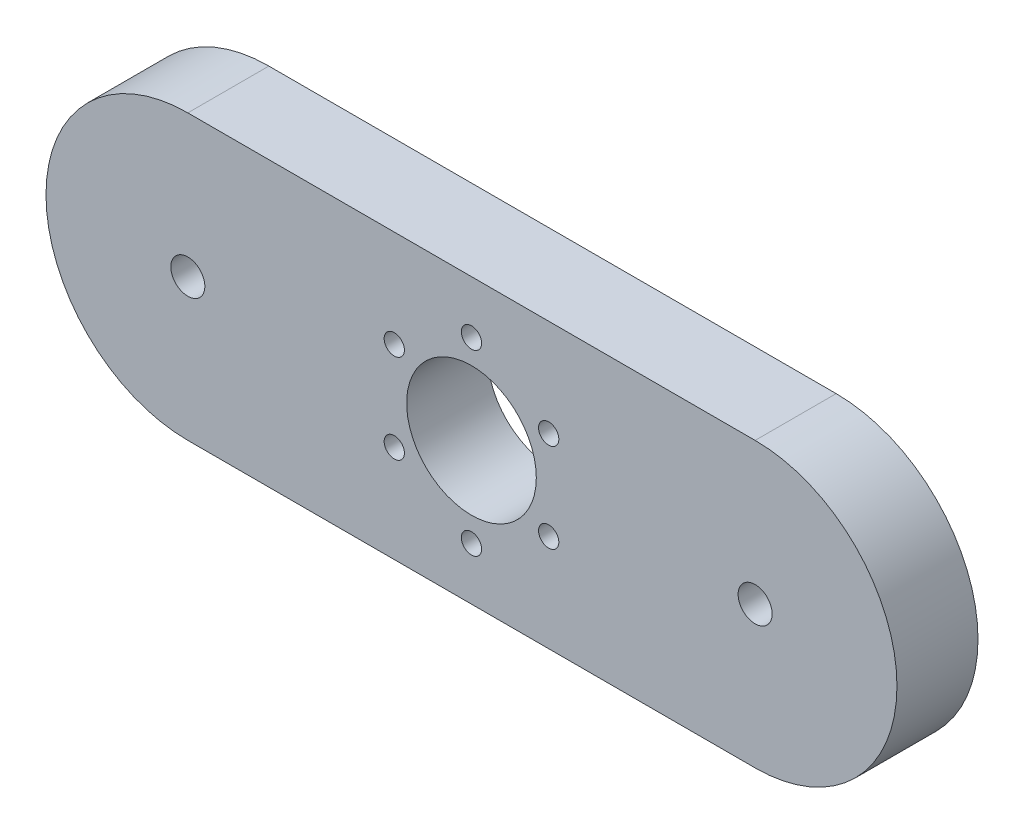
ISO-10303-21;
HEADER;
FILE_DESCRIPTION(('STEP AP214'),'2;1');
FILE_NAME('part.step','',(''),(''),'','','');
FILE_SCHEMA(('AUTOMOTIVE_DESIGN { 1 0 10303 214 1 1 1 1 }'));
ENDSEC;
DATA;
#1=APPLICATION_CONTEXT('core data for automotive mechanical design processes');
#2=APPLICATION_PROTOCOL_DEFINITION('international standard','automotive_design',2000,#1);
#3=PRODUCT_CONTEXT('',#1,'mechanical');
#4=PRODUCT('Part','Part','',(#3));
#5=PRODUCT_RELATED_PRODUCT_CATEGORY('part','',(#4));
#6=PRODUCT_DEFINITION_FORMATION('','',#4);
#7=PRODUCT_DEFINITION_CONTEXT('part definition',#1,'design');
#8=PRODUCT_DEFINITION('design','',#6,#7);
#9=PRODUCT_DEFINITION_SHAPE('','',#8);
#10=(LENGTH_UNIT() NAMED_UNIT(*) SI_UNIT(.MILLI.,.METRE.));
#11=(NAMED_UNIT(*) PLANE_ANGLE_UNIT() SI_UNIT($,.RADIAN.));
#12=(NAMED_UNIT(*) SI_UNIT($,.STERADIAN.) SOLID_ANGLE_UNIT());
#13=UNCERTAINTY_MEASURE_WITH_UNIT(LENGTH_MEASURE(1.E-05),#10,'distance_accuracy_value','');
#14=(GEOMETRIC_REPRESENTATION_CONTEXT(3) GLOBAL_UNCERTAINTY_ASSIGNED_CONTEXT((#13)) GLOBAL_UNIT_ASSIGNED_CONTEXT((#10,
#11,#12)) REPRESENTATION_CONTEXT('',''));
#15=CARTESIAN_POINT('',(0.,0.,0.));
#16=DIRECTION('',(0.,0.,1.));
#17=DIRECTION('',(1.,0.,0.));
#18=AXIS2_PLACEMENT_3D('',#15,#16,#17);
#19=CARTESIAN_POINT('',(-35.,0.,10.));
#20=DIRECTION('',(0.,0.,1.));
#21=DIRECTION('',(1.,0.,0.));
#22=AXIS2_PLACEMENT_3D('',#19,#20,#21);
#23=PLANE('',#22);
#24=CARTESIAN_POINT('',(-9.52627944162789,-5.50000000000054,10.));
#25=DIRECTION('',(0.,0.,1.));
#26=DIRECTION('',(1.,0.,0.));
#27=AXIS2_PLACEMENT_3D('',#24,#25,#26);
#28=CIRCLE('',#27,1.25000000000115);
#29=CARTESIAN_POINT('',(-8.27627944162673,-5.50000000000054,10.));
#30=VERTEX_POINT('',#29);
#31=EDGE_CURVE('E150',#30,#30,#28,.T.);
#32=ORIENTED_EDGE('',*,*,#31,.F.);
#33=EDGE_LOOP('',(#32));
#34=FACE_BOUND('',#33,.T.);
#35=CARTESIAN_POINT('',(9.5262794416288,-5.50000000000005,10.));
#36=DIRECTION('',(0.,0.,1.));
#37=DIRECTION('',(1.,0.,0.));
#38=AXIS2_PLACEMENT_3D('',#35,#36,#37);
#39=CIRCLE('',#38,1.25);
#40=CARTESIAN_POINT('',(10.7762794416288,-5.50000000000005,10.));
#41=VERTEX_POINT('',#40);
#42=EDGE_CURVE('E138',#41,#41,#39,.T.);
#43=ORIENTED_EDGE('',*,*,#42,.F.);
#44=EDGE_LOOP('',(#43));
#45=FACE_BOUND('',#44,.T.);
#46=CARTESIAN_POINT('',(35.,0.,10.));
#47=DIRECTION('',(0.,0.,1.));
#48=DIRECTION('',(1.,0.,0.));
#49=AXIS2_PLACEMENT_3D('',#46,#47,#48);
#50=CIRCLE('',#49,2.1);
#51=CARTESIAN_POINT('',(37.1,0.,10.));
#52=VERTEX_POINT('',#51);
#53=EDGE_CURVE('E126',#52,#52,#50,.T.);
#54=ORIENTED_EDGE('',*,*,#53,.F.);
#55=EDGE_LOOP('',(#54));
#56=FACE_BOUND('',#55,.T.);
#57=CARTESIAN_POINT('',(0.,11.,10.));
#58=DIRECTION('',(0.,0.,1.));
#59=DIRECTION('',(1.,0.,0.));
#60=AXIS2_PLACEMENT_3D('',#57,#58,#59);
#61=CIRCLE('',#60,1.25);
#62=CARTESIAN_POINT('',(1.25,11.,10.));
#63=VERTEX_POINT('',#62);
#64=EDGE_CURVE('E114',#63,#63,#61,.T.);
#65=ORIENTED_EDGE('',*,*,#64,.F.);
#66=EDGE_LOOP('',(#65));
#67=FACE_BOUND('',#66,.T.);
#68=CARTESIAN_POINT('',(-35.,0.,10.));
#69=DIRECTION('',(0.,0.,1.));
#70=DIRECTION('',(1.,0.,0.));
#71=AXIS2_PLACEMENT_3D('',#68,#69,#70);
#72=CIRCLE('',#71,17.5);
#73=CARTESIAN_POINT('',(-35.,17.5,10.));
#74=VERTEX_POINT('',#73);
#75=CARTESIAN_POINT('',(-35.,-17.5,10.));
#76=VERTEX_POINT('',#75);
#77=EDGE_CURVE('E84',#74,#76,#72,.T.);
#78=ORIENTED_EDGE('',*,*,#77,.T.);
#79=DIRECTION('',(1.,0.,0.));
#80=VECTOR('',#79,1.);
#81=CARTESIAN_POINT('',(-35.,-17.5,10.));
#82=LINE('',#81,#80);
#83=CARTESIAN_POINT('',(35.,-17.5,10.));
#84=VERTEX_POINT('',#83);
#85=EDGE_CURVE('E79',#76,#84,#82,.T.);
#86=ORIENTED_EDGE('',*,*,#85,.T.);
#87=CARTESIAN_POINT('',(35.,0.,10.));
#88=DIRECTION('',(0.,0.,1.));
#89=DIRECTION('',(1.,0.,0.));
#90=AXIS2_PLACEMENT_3D('',#87,#88,#89);
#91=CIRCLE('',#90,17.5);
#92=CARTESIAN_POINT('',(35.,17.5,10.));
#93=VERTEX_POINT('',#92);
#94=EDGE_CURVE('E82',#84,#93,#91,.T.);
#95=ORIENTED_EDGE('',*,*,#94,.T.);
#96=DIRECTION('',(-1.,0.,0.));
#97=VECTOR('',#96,1.);
#98=CARTESIAN_POINT('',(-35.,17.5,10.));
#99=LINE('',#98,#97);
#100=EDGE_CURVE('E49',#93,#74,#99,.T.);
#101=ORIENTED_EDGE('',*,*,#100,.T.);
#102=EDGE_LOOP('',(#78,#86,#95,#101));
#103=FACE_BOUND('',#102,.T.);
#104=CARTESIAN_POINT('',(0.,0.,10.));
#105=DIRECTION('',(0.,0.,1.));
#106=DIRECTION('',(1.,0.,0.));
#107=AXIS2_PLACEMENT_3D('',#104,#105,#106);
#108=CIRCLE('',#107,8.);
#109=CARTESIAN_POINT('',(8.,0.,10.));
#110=VERTEX_POINT('',#109);
#111=EDGE_CURVE('E99',#110,#110,#108,.T.);
#112=ORIENTED_EDGE('',*,*,#111,.F.);
#113=EDGE_LOOP('',(#112));
#114=FACE_BOUND('',#113,.T.);
#115=CARTESIAN_POINT('',(-35.,0.,10.));
#116=DIRECTION('',(0.,0.,1.));
#117=DIRECTION('',(1.,0.,0.));
#118=AXIS2_PLACEMENT_3D('',#115,#116,#117);
#119=CIRCLE('',#118,2.1);
#120=CARTESIAN_POINT('',(-32.9,0.,10.));
#121=VERTEX_POINT('',#120);
#122=EDGE_CURVE('E120',#121,#121,#119,.T.);
#123=ORIENTED_EDGE('',*,*,#122,.F.);
#124=EDGE_LOOP('',(#123));
#125=FACE_BOUND('',#124,.T.);
#126=CARTESIAN_POINT('',(9.52627944162884,5.49999999999998,10.));
#127=DIRECTION('',(0.,0.,1.));
#128=DIRECTION('',(1.,0.,0.));
#129=AXIS2_PLACEMENT_3D('',#126,#127,#128);
#130=CIRCLE('',#129,1.25);
#131=CARTESIAN_POINT('',(10.7762794416288,5.49999999999998,10.));
#132=VERTEX_POINT('',#131);
#133=EDGE_CURVE('E132',#132,#132,#130,.T.);
#134=ORIENTED_EDGE('',*,*,#133,.F.);
#135=EDGE_LOOP('',(#134));
#136=FACE_BOUND('',#135,.T.);
#137=CARTESIAN_POINT('',(1.24786099197965E-12,-11.,10.));
#138=DIRECTION('',(0.,0.,1.));
#139=DIRECTION('',(1.,0.,0.));
#140=AXIS2_PLACEMENT_3D('',#137,#138,#139);
#141=CIRCLE('',#140,1.25000000000127);
#142=CARTESIAN_POINT('',(1.25000000000251,-11.,10.));
#143=VERTEX_POINT('',#142);
#144=EDGE_CURVE('E144',#143,#143,#141,.T.);
#145=ORIENTED_EDGE('',*,*,#144,.F.);
#146=EDGE_LOOP('',(#145));
#147=FACE_BOUND('',#146,.T.);
#148=CARTESIAN_POINT('',(-9.52627944162876,5.50000000000011,10.));
#149=DIRECTION('',(0.,0.,1.));
#150=DIRECTION('',(1.,0.,0.));
#151=AXIS2_PLACEMENT_3D('',#148,#149,#150);
#152=CIRCLE('',#151,1.25);
#153=CARTESIAN_POINT('',(-8.27627944162876,5.50000000000011,10.));
#154=VERTEX_POINT('',#153);
#155=EDGE_CURVE('E156',#154,#154,#152,.T.);
#156=ORIENTED_EDGE('',*,*,#155,.F.);
#157=EDGE_LOOP('',(#156));
#158=FACE_BOUND('',#157,.T.);
#159=ADVANCED_FACE('F32',(#34,#45,#56,#67,#103,#114,#125,#136,#147,#158),#23,.T.);
#160=CARTESIAN_POINT('',(-35.,0.,0.));
#161=DIRECTION('',(0.,0.,1.));
#162=DIRECTION('',(1.,0.,0.));
#163=AXIS2_PLACEMENT_3D('',#160,#161,#162);
#164=PLANE('',#163);
#165=CARTESIAN_POINT('',(-9.52627944162789,-5.50000000000054,0.));
#166=DIRECTION('',(0.,0.,1.));
#167=DIRECTION('',(1.,0.,0.));
#168=AXIS2_PLACEMENT_3D('',#165,#166,#167);
#169=CIRCLE('',#168,1.25000000000115);
#170=CARTESIAN_POINT('',(-8.27627944162673,-5.50000000000054,0.));
#171=VERTEX_POINT('',#170);
#172=EDGE_CURVE('E153',#171,#171,#169,.T.);
#173=ORIENTED_EDGE('',*,*,#172,.T.);
#174=EDGE_LOOP('',(#173));
#175=FACE_BOUND('',#174,.T.);
#176=CARTESIAN_POINT('',(9.5262794416288,-5.50000000000005,0.));
#177=DIRECTION('',(0.,0.,1.));
#178=DIRECTION('',(1.,0.,0.));
#179=AXIS2_PLACEMENT_3D('',#176,#177,#178);
#180=CIRCLE('',#179,1.25);
#181=CARTESIAN_POINT('',(10.7762794416288,-5.50000000000005,0.));
#182=VERTEX_POINT('',#181);
#183=EDGE_CURVE('E141',#182,#182,#180,.T.);
#184=ORIENTED_EDGE('',*,*,#183,.T.);
#185=EDGE_LOOP('',(#184));
#186=FACE_BOUND('',#185,.T.);
#187=CARTESIAN_POINT('',(35.,0.,0.));
#188=DIRECTION('',(0.,0.,1.));
#189=DIRECTION('',(1.,0.,0.));
#190=AXIS2_PLACEMENT_3D('',#187,#188,#189);
#191=CIRCLE('',#190,2.1);
#192=CARTESIAN_POINT('',(37.1,0.,0.));
#193=VERTEX_POINT('',#192);
#194=EDGE_CURVE('E129',#193,#193,#191,.T.);
#195=ORIENTED_EDGE('',*,*,#194,.T.);
#196=EDGE_LOOP('',(#195));
#197=FACE_BOUND('',#196,.T.);
#198=CARTESIAN_POINT('',(0.,11.,0.));
#199=DIRECTION('',(0.,0.,1.));
#200=DIRECTION('',(1.,0.,0.));
#201=AXIS2_PLACEMENT_3D('',#198,#199,#200);
#202=CIRCLE('',#201,1.25);
#203=CARTESIAN_POINT('',(1.25,11.,0.));
#204=VERTEX_POINT('',#203);
#205=EDGE_CURVE('E117',#204,#204,#202,.T.);
#206=ORIENTED_EDGE('',*,*,#205,.T.);
#207=EDGE_LOOP('',(#206));
#208=FACE_BOUND('',#207,.T.);
#209=CARTESIAN_POINT('',(-35.,0.,0.));
#210=DIRECTION('',(0.,0.,1.));
#211=DIRECTION('',(1.,0.,0.));
#212=AXIS2_PLACEMENT_3D('',#209,#210,#211);
#213=CIRCLE('',#212,17.5);
#214=CARTESIAN_POINT('',(-35.,17.5,0.));
#215=VERTEX_POINT('',#214);
#216=CARTESIAN_POINT('',(-35.,-17.5,0.));
#217=VERTEX_POINT('',#216);
#218=EDGE_CURVE('E96',#215,#217,#213,.T.);
#219=ORIENTED_EDGE('',*,*,#218,.F.);
#220=DIRECTION('',(-1.,0.,0.));
#221=VECTOR('',#220,1.);
#222=CARTESIAN_POINT('',(-35.,17.5,0.));
#223=LINE('',#222,#221);
#224=CARTESIAN_POINT('',(35.,17.5,0.));
#225=VERTEX_POINT('',#224);
#226=EDGE_CURVE('E72',#225,#215,#223,.T.);
#227=ORIENTED_EDGE('',*,*,#226,.F.);
#228=CARTESIAN_POINT('',(35.,0.,0.));
#229=DIRECTION('',(0.,0.,1.));
#230=DIRECTION('',(1.,0.,0.));
#231=AXIS2_PLACEMENT_3D('',#228,#229,#230);
#232=CIRCLE('',#231,17.5);
#233=CARTESIAN_POINT('',(35.,-17.5,0.));
#234=VERTEX_POINT('',#233);
#235=EDGE_CURVE('E66',#234,#225,#232,.T.);
#236=ORIENTED_EDGE('',*,*,#235,.F.);
#237=DIRECTION('',(1.,0.,0.));
#238=VECTOR('',#237,1.);
#239=CARTESIAN_POINT('',(-35.,-17.5,0.));
#240=LINE('',#239,#238);
#241=EDGE_CURVE('E88',#217,#234,#240,.T.);
#242=ORIENTED_EDGE('',*,*,#241,.F.);
#243=EDGE_LOOP('',(#219,#227,#236,#242));
#244=FACE_BOUND('',#243,.T.);
#245=CARTESIAN_POINT('',(0.,0.,0.));
#246=DIRECTION('',(0.,0.,1.));
#247=DIRECTION('',(1.,0.,0.));
#248=AXIS2_PLACEMENT_3D('',#245,#246,#247);
#249=CIRCLE('',#248,8.);
#250=CARTESIAN_POINT('',(8.,0.,0.));
#251=VERTEX_POINT('',#250);
#252=EDGE_CURVE('E111',#251,#251,#249,.T.);
#253=ORIENTED_EDGE('',*,*,#252,.T.);
#254=EDGE_LOOP('',(#253));
#255=FACE_BOUND('',#254,.T.);
#256=CARTESIAN_POINT('',(-35.,0.,0.));
#257=DIRECTION('',(0.,0.,1.));
#258=DIRECTION('',(1.,0.,0.));
#259=AXIS2_PLACEMENT_3D('',#256,#257,#258);
#260=CIRCLE('',#259,2.1);
#261=CARTESIAN_POINT('',(-32.9,0.,0.));
#262=VERTEX_POINT('',#261);
#263=EDGE_CURVE('E123',#262,#262,#260,.T.);
#264=ORIENTED_EDGE('',*,*,#263,.T.);
#265=EDGE_LOOP('',(#264));
#266=FACE_BOUND('',#265,.T.);
#267=CARTESIAN_POINT('',(9.52627944162884,5.49999999999998,0.));
#268=DIRECTION('',(0.,0.,1.));
#269=DIRECTION('',(1.,0.,0.));
#270=AXIS2_PLACEMENT_3D('',#267,#268,#269);
#271=CIRCLE('',#270,1.25);
#272=CARTESIAN_POINT('',(10.7762794416288,5.49999999999998,0.));
#273=VERTEX_POINT('',#272);
#274=EDGE_CURVE('E135',#273,#273,#271,.T.);
#275=ORIENTED_EDGE('',*,*,#274,.T.);
#276=EDGE_LOOP('',(#275));
#277=FACE_BOUND('',#276,.T.);
#278=CARTESIAN_POINT('',(1.24786099197965E-12,-11.,0.));
#279=DIRECTION('',(0.,0.,1.));
#280=DIRECTION('',(1.,0.,0.));
#281=AXIS2_PLACEMENT_3D('',#278,#279,#280);
#282=CIRCLE('',#281,1.25000000000127);
#283=CARTESIAN_POINT('',(1.25000000000251,-11.,0.));
#284=VERTEX_POINT('',#283);
#285=EDGE_CURVE('E147',#284,#284,#282,.T.);
#286=ORIENTED_EDGE('',*,*,#285,.T.);
#287=EDGE_LOOP('',(#286));
#288=FACE_BOUND('',#287,.T.);
#289=CARTESIAN_POINT('',(-9.52627944162876,5.50000000000011,0.));
#290=DIRECTION('',(0.,0.,1.));
#291=DIRECTION('',(1.,0.,0.));
#292=AXIS2_PLACEMENT_3D('',#289,#290,#291);
#293=CIRCLE('',#292,1.25);
#294=CARTESIAN_POINT('',(-8.27627944162876,5.50000000000011,0.));
#295=VERTEX_POINT('',#294);
#296=EDGE_CURVE('E159',#295,#295,#293,.T.);
#297=ORIENTED_EDGE('',*,*,#296,.T.);
#298=EDGE_LOOP('',(#297));
#299=FACE_BOUND('',#298,.T.);
#300=ADVANCED_FACE('F107',(#175,#186,#197,#208,#244,#255,#266,#277,#288,#299),#164,.F.);
#301=CARTESIAN_POINT('',(-35.,0.,10.));
#302=DIRECTION('',(0.,0.,-1.));
#303=DIRECTION('',(-1.,0.,0.));
#304=AXIS2_PLACEMENT_3D('',#301,#302,#303);
#305=CYLINDRICAL_SURFACE('',#304,17.5);
#306=ORIENTED_EDGE('',*,*,#218,.T.);
#307=DIRECTION('',(0.,0.,-1.));
#308=VECTOR('',#307,1.);
#309=CARTESIAN_POINT('',(-35.,-17.5,10.));
#310=LINE('',#309,#308);
#311=EDGE_CURVE('E11',#76,#217,#310,.T.);
#312=ORIENTED_EDGE('',*,*,#311,.F.);
#313=ORIENTED_EDGE('',*,*,#77,.F.);
#314=DIRECTION('',(0.,0.,-1.));
#315=VECTOR('',#314,1.);
#316=CARTESIAN_POINT('',(-35.,17.5,10.));
#317=LINE('',#316,#315);
#318=EDGE_CURVE('E92',#74,#215,#317,.T.);
#319=ORIENTED_EDGE('',*,*,#318,.T.);
#320=EDGE_LOOP('',(#306,#312,#313,#319));
#321=FACE_BOUND('',#320,.T.);
#322=ADVANCED_FACE('F34',(#321),#305,.T.);
#323=CARTESIAN_POINT('',(-35.,-17.5,10.));
#324=DIRECTION('',(0.,1.,0.));
#325=DIRECTION('',(0.,0.,1.));
#326=AXIS2_PLACEMENT_3D('',#323,#324,#325);
#327=PLANE('',#326);
#328=ORIENTED_EDGE('',*,*,#241,.T.);
#329=DIRECTION('',(0.,0.,-1.));
#330=VECTOR('',#329,1.);
#331=CARTESIAN_POINT('',(35.,-17.5,10.));
#332=LINE('',#331,#330);
#333=EDGE_CURVE('E41',#84,#234,#332,.T.);
#334=ORIENTED_EDGE('',*,*,#333,.F.);
#335=ORIENTED_EDGE('',*,*,#85,.F.);
#336=ORIENTED_EDGE('',*,*,#311,.T.);
#337=EDGE_LOOP('',(#328,#334,#335,#336));
#338=FACE_BOUND('',#337,.T.);
#339=ADVANCED_FACE('F87',(#338),#327,.F.);
#340=CARTESIAN_POINT('',(35.,0.,10.));
#341=DIRECTION('',(0.,0.,-1.));
#342=DIRECTION('',(-1.,0.,0.));
#343=AXIS2_PLACEMENT_3D('',#340,#341,#342);
#344=CYLINDRICAL_SURFACE('',#343,17.5);
#345=ORIENTED_EDGE('',*,*,#235,.T.);
#346=DIRECTION('',(0.,0.,-1.));
#347=VECTOR('',#346,1.);
#348=CARTESIAN_POINT('',(35.,17.5,10.));
#349=LINE('',#348,#347);
#350=EDGE_CURVE('E89',#93,#225,#349,.T.);
#351=ORIENTED_EDGE('',*,*,#350,.F.);
#352=ORIENTED_EDGE('',*,*,#94,.F.);
#353=ORIENTED_EDGE('',*,*,#333,.T.);
#354=EDGE_LOOP('',(#345,#351,#352,#353));
#355=FACE_BOUND('',#354,.T.);
#356=ADVANCED_FACE('F90',(#355),#344,.T.);
#357=CARTESIAN_POINT('',(-35.,17.5,10.));
#358=DIRECTION('',(0.,-1.,0.));
#359=DIRECTION('',(0.,0.,-1.));
#360=AXIS2_PLACEMENT_3D('',#357,#358,#359);
#361=PLANE('',#360);
#362=ORIENTED_EDGE('',*,*,#226,.T.);
#363=ORIENTED_EDGE('',*,*,#318,.F.);
#364=ORIENTED_EDGE('',*,*,#100,.F.);
#365=ORIENTED_EDGE('',*,*,#350,.T.);
#366=EDGE_LOOP('',(#362,#363,#364,#365));
#367=FACE_BOUND('',#366,.T.);
#368=ADVANCED_FACE('F104',(#367),#361,.F.);
#369=CARTESIAN_POINT('',(0.,0.,10.));
#370=DIRECTION('',(0.,0.,-1.));
#371=DIRECTION('',(-1.,0.,0.));
#372=AXIS2_PLACEMENT_3D('',#369,#370,#371);
#373=CYLINDRICAL_SURFACE('',#372,8.);
#374=ORIENTED_EDGE('',*,*,#111,.T.);
#375=EDGE_LOOP('',(#374));
#376=FACE_BOUND('',#375,.T.);
#377=ORIENTED_EDGE('',*,*,#252,.F.);
#378=EDGE_LOOP('',(#377));
#379=FACE_BOUND('',#378,.T.);
#380=ADVANCED_FACE('F179',(#376,#379),#373,.F.);
#381=CARTESIAN_POINT('',(0.,11.,10.));
#382=DIRECTION('',(0.,0.,-1.));
#383=DIRECTION('',(-1.,0.,0.));
#384=AXIS2_PLACEMENT_3D('',#381,#382,#383);
#385=CYLINDRICAL_SURFACE('',#384,1.25);
#386=ORIENTED_EDGE('',*,*,#64,.T.);
#387=EDGE_LOOP('',(#386));
#388=FACE_BOUND('',#387,.T.);
#389=ORIENTED_EDGE('',*,*,#205,.F.);
#390=EDGE_LOOP('',(#389));
#391=FACE_BOUND('',#390,.T.);
#392=ADVANCED_FACE('F225',(#388,#391),#385,.F.);
#393=CARTESIAN_POINT('',(-35.,0.,10.));
#394=DIRECTION('',(0.,0.,-1.));
#395=DIRECTION('',(-1.,0.,0.));
#396=AXIS2_PLACEMENT_3D('',#393,#394,#395);
#397=CYLINDRICAL_SURFACE('',#396,2.1);
#398=ORIENTED_EDGE('',*,*,#122,.T.);
#399=EDGE_LOOP('',(#398));
#400=FACE_BOUND('',#399,.T.);
#401=ORIENTED_EDGE('',*,*,#263,.F.);
#402=EDGE_LOOP('',(#401));
#403=FACE_BOUND('',#402,.T.);
#404=ADVANCED_FACE('F233',(#400,#403),#397,.F.);
#405=CARTESIAN_POINT('',(35.,0.,10.));
#406=DIRECTION('',(0.,0.,-1.));
#407=DIRECTION('',(-1.,0.,0.));
#408=AXIS2_PLACEMENT_3D('',#405,#406,#407);
#409=CYLINDRICAL_SURFACE('',#408,2.1);
#410=ORIENTED_EDGE('',*,*,#53,.T.);
#411=EDGE_LOOP('',(#410));
#412=FACE_BOUND('',#411,.T.);
#413=ORIENTED_EDGE('',*,*,#194,.F.);
#414=EDGE_LOOP('',(#413));
#415=FACE_BOUND('',#414,.T.);
#416=ADVANCED_FACE('F241',(#412,#415),#409,.F.);
#417=CARTESIAN_POINT('',(9.52627944162884,5.49999999999998,10.));
#418=DIRECTION('',(0.,0.,-1.));
#419=DIRECTION('',(-1.,0.,0.));
#420=AXIS2_PLACEMENT_3D('',#417,#418,#419);
#421=CYLINDRICAL_SURFACE('',#420,1.25);
#422=ORIENTED_EDGE('',*,*,#133,.T.);
#423=EDGE_LOOP('',(#422));
#424=FACE_BOUND('',#423,.T.);
#425=ORIENTED_EDGE('',*,*,#274,.F.);
#426=EDGE_LOOP('',(#425));
#427=FACE_BOUND('',#426,.T.);
#428=ADVANCED_FACE('F250',(#424,#427),#421,.F.);
#429=CARTESIAN_POINT('',(9.5262794416288,-5.50000000000005,10.));
#430=DIRECTION('',(0.,0.,-1.));
#431=DIRECTION('',(-1.,0.,0.));
#432=AXIS2_PLACEMENT_3D('',#429,#430,#431);
#433=CYLINDRICAL_SURFACE('',#432,1.25);
#434=ORIENTED_EDGE('',*,*,#42,.T.);
#435=EDGE_LOOP('',(#434));
#436=FACE_BOUND('',#435,.T.);
#437=ORIENTED_EDGE('',*,*,#183,.F.);
#438=EDGE_LOOP('',(#437));
#439=FACE_BOUND('',#438,.T.);
#440=ADVANCED_FACE('F259',(#436,#439),#433,.F.);
#441=CARTESIAN_POINT('',(1.24786099197965E-12,-11.,10.));
#442=DIRECTION('',(0.,0.,-1.));
#443=DIRECTION('',(-1.,0.,0.));
#444=AXIS2_PLACEMENT_3D('',#441,#442,#443);
#445=CYLINDRICAL_SURFACE('',#444,1.25000000000127);
#446=ORIENTED_EDGE('',*,*,#144,.T.);
#447=EDGE_LOOP('',(#446));
#448=FACE_BOUND('',#447,.T.);
#449=ORIENTED_EDGE('',*,*,#285,.F.);
#450=EDGE_LOOP('',(#449));
#451=FACE_BOUND('',#450,.T.);
#452=ADVANCED_FACE('F268',(#448,#451),#445,.F.);
#453=CARTESIAN_POINT('',(-9.52627944162789,-5.50000000000054,10.));
#454=DIRECTION('',(0.,0.,-1.));
#455=DIRECTION('',(-1.,0.,0.));
#456=AXIS2_PLACEMENT_3D('',#453,#454,#455);
#457=CYLINDRICAL_SURFACE('',#456,1.25000000000115);
#458=ORIENTED_EDGE('',*,*,#31,.T.);
#459=EDGE_LOOP('',(#458));
#460=FACE_BOUND('',#459,.T.);
#461=ORIENTED_EDGE('',*,*,#172,.F.);
#462=EDGE_LOOP('',(#461));
#463=FACE_BOUND('',#462,.T.);
#464=ADVANCED_FACE('F277',(#460,#463),#457,.F.);
#465=CARTESIAN_POINT('',(-9.52627944162876,5.50000000000011,10.));
#466=DIRECTION('',(0.,0.,-1.));
#467=DIRECTION('',(-1.,0.,0.));
#468=AXIS2_PLACEMENT_3D('',#465,#466,#467);
#469=CYLINDRICAL_SURFACE('',#468,1.25);
#470=ORIENTED_EDGE('',*,*,#155,.T.);
#471=EDGE_LOOP('',(#470));
#472=FACE_BOUND('',#471,.T.);
#473=ORIENTED_EDGE('',*,*,#296,.F.);
#474=EDGE_LOOP('',(#473));
#475=FACE_BOUND('',#474,.T.);
#476=ADVANCED_FACE('F165',(#472,#475),#469,.F.);
#477=CLOSED_SHELL('',(#159,#300,#322,#339,#356,#368,#380,#392,#404,#416,#428,#440,#452,#464,#476));
#478=MANIFOLD_SOLID_BREP('B2',#477);
#479=ADVANCED_BREP_SHAPE_REPRESENTATION('',(#18,#478),#14);
#480=SHAPE_DEFINITION_REPRESENTATION(#9,#479);
ENDSEC;
END-ISO-10303-21;
